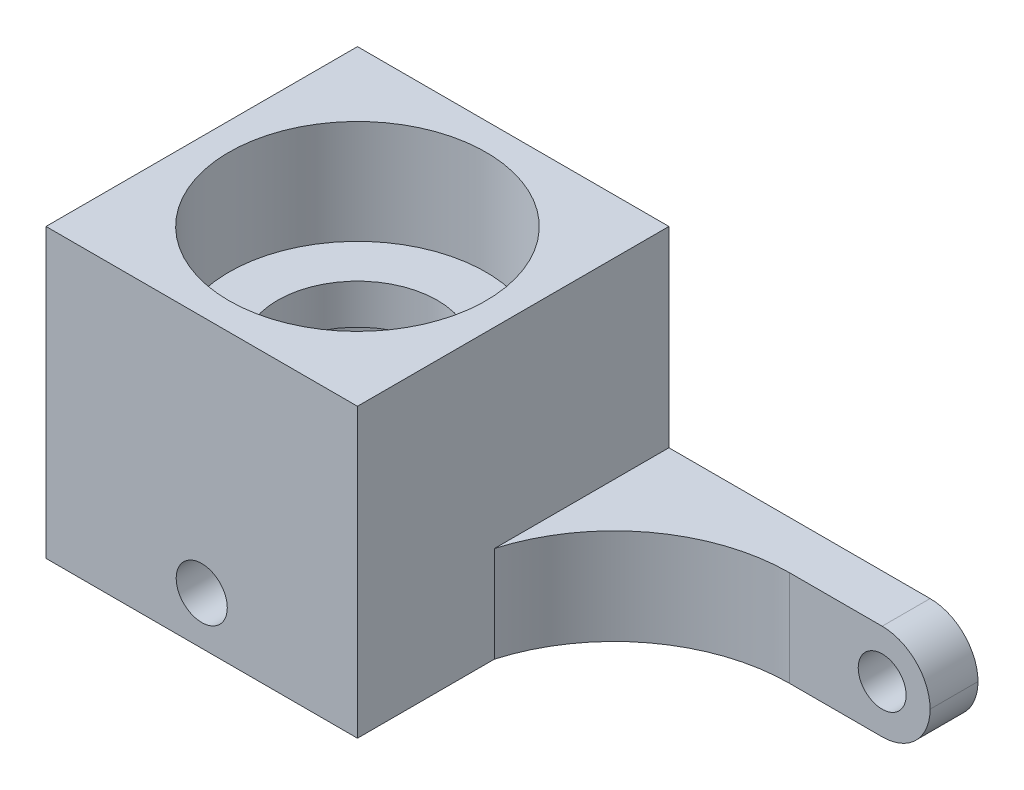
ISO-10303-21;
HEADER;
FILE_DESCRIPTION(('STEP AP214'),'2;1');
FILE_NAME('part.step','',(''),(''),'','','');
FILE_SCHEMA(('AUTOMOTIVE_DESIGN { 1 0 10303 214 1 1 1 1 }'));
ENDSEC;
DATA;
#1=APPLICATION_CONTEXT('core data for automotive mechanical design processes');
#2=APPLICATION_PROTOCOL_DEFINITION('international standard','automotive_design',2000,#1);
#3=PRODUCT_CONTEXT('',#1,'mechanical');
#4=PRODUCT('Part','Part','',(#3));
#5=PRODUCT_RELATED_PRODUCT_CATEGORY('part','',(#4));
#6=PRODUCT_DEFINITION_FORMATION('','',#4);
#7=PRODUCT_DEFINITION_CONTEXT('part definition',#1,'design');
#8=PRODUCT_DEFINITION('design','',#6,#7);
#9=PRODUCT_DEFINITION_SHAPE('','',#8);
#10=(LENGTH_UNIT() NAMED_UNIT(*) SI_UNIT(.MILLI.,.METRE.));
#11=(NAMED_UNIT(*) PLANE_ANGLE_UNIT() SI_UNIT($,.RADIAN.));
#12=(NAMED_UNIT(*) SI_UNIT($,.STERADIAN.) SOLID_ANGLE_UNIT());
#13=UNCERTAINTY_MEASURE_WITH_UNIT(LENGTH_MEASURE(1.E-05),#10,'distance_accuracy_value','');
#14=(GEOMETRIC_REPRESENTATION_CONTEXT(3) GLOBAL_UNCERTAINTY_ASSIGNED_CONTEXT((#13)) GLOBAL_UNIT_ASSIGNED_CONTEXT((#10,
#11,#12)) REPRESENTATION_CONTEXT('',''));
#15=CARTESIAN_POINT('',(0.,0.,0.));
#16=DIRECTION('',(0.,0.,1.));
#17=DIRECTION('',(1.,0.,0.));
#18=AXIS2_PLACEMENT_3D('',#15,#16,#17);
#19=CARTESIAN_POINT('',(0.,18.,0.));
#20=DIRECTION('',(0.,1.,0.));
#21=DIRECTION('',(0.,0.,1.));
#22=AXIS2_PLACEMENT_3D('',#19,#20,#21);
#23=PLANE('',#22);
#24=CARTESIAN_POINT('',(0.,18.,0.));
#25=DIRECTION('',(0.,1.,0.));
#26=DIRECTION('',(0.,0.,1.));
#27=AXIS2_PLACEMENT_3D('',#24,#25,#26);
#28=CIRCLE('',#27,8.05);
#29=CARTESIAN_POINT('',(0.,18.,8.05));
#30=VERTEX_POINT('',#29);
#31=EDGE_CURVE('E153',#30,#30,#28,.T.);
#32=ORIENTED_EDGE('',*,*,#31,.F.);
#33=EDGE_LOOP('',(#32));
#34=FACE_BOUND('',#33,.T.);
#35=DIRECTION('',(0.,0.,-1.));
#36=VECTOR('',#35,1.);
#37=CARTESIAN_POINT('',(-9.75,18.,-6.75));
#38=LINE('',#37,#36);
#39=CARTESIAN_POINT('',(-9.75,18.,9.75));
#40=VERTEX_POINT('',#39);
#41=CARTESIAN_POINT('',(-9.75,18.,-9.75));
#42=VERTEX_POINT('',#41);
#43=EDGE_CURVE('E170',#40,#42,#38,.T.);
#44=ORIENTED_EDGE('',*,*,#43,.F.);
#45=DIRECTION('',(-1.,0.,0.));
#46=VECTOR('',#45,1.);
#47=CARTESIAN_POINT('',(-9.75,18.,9.75));
#48=LINE('',#47,#46);
#49=CARTESIAN_POINT('',(9.75,18.,9.75));
#50=VERTEX_POINT('',#49);
#51=EDGE_CURVE('E137',#50,#40,#48,.T.);
#52=ORIENTED_EDGE('',*,*,#51,.F.);
#53=DIRECTION('',(0.,0.,-1.));
#54=VECTOR('',#53,1.);
#55=CARTESIAN_POINT('',(9.75,18.,-6.75));
#56=LINE('',#55,#54);
#57=CARTESIAN_POINT('',(9.75,18.,-9.75));
#58=VERTEX_POINT('',#57);
#59=EDGE_CURVE('E188',#50,#58,#56,.T.);
#60=ORIENTED_EDGE('',*,*,#59,.T.);
#61=DIRECTION('',(1.,0.,0.));
#62=VECTOR('',#61,1.);
#63=CARTESIAN_POINT('',(0.,18.,-9.75));
#64=LINE('',#63,#62);
#65=EDGE_CURVE('E172',#42,#58,#64,.T.);
#66=ORIENTED_EDGE('',*,*,#65,.F.);
#67=EDGE_LOOP('',(#44,#52,#60,#66));
#68=FACE_BOUND('',#67,.T.);
#69=ADVANCED_FACE('F39',(#34,#68),#23,.T.);
#70=CARTESIAN_POINT('',(0.,0.,0.));
#71=DIRECTION('',(0.,1.,0.));
#72=DIRECTION('',(0.,0.,1.));
#73=AXIS2_PLACEMENT_3D('',#70,#71,#72);
#74=PLANE('',#73);
#75=CARTESIAN_POINT('',(0.,0.,0.));
#76=DIRECTION('',(0.,1.,0.));
#77=DIRECTION('',(0.,0.,1.));
#78=AXIS2_PLACEMENT_3D('',#75,#76,#77);
#79=CIRCLE('',#78,7.5);
#80=CARTESIAN_POINT('',(0.,0.,7.5));
#81=VERTEX_POINT('',#80);
#82=EDGE_CURVE('E152',#81,#81,#79,.T.);
#83=ORIENTED_EDGE('',*,*,#82,.T.);
#84=EDGE_LOOP('',(#83));
#85=FACE_BOUND('',#84,.T.);
#86=CARTESIAN_POINT('',(20.3100960115899,0.,4.25));
#87=DIRECTION('',(0.,1.,0.));
#88=DIRECTION('',(0.,0.,1.));
#89=AXIS2_PLACEMENT_3D('',#86,#87,#88);
#90=CIRCLE('',#89,11.);
#91=CARTESIAN_POINT('',(20.3100960115899,0.,-6.75));
#92=VERTEX_POINT('',#91);
#93=CARTESIAN_POINT('',(9.75,0.,1.17032920168355));
#94=VERTEX_POINT('',#93);
#95=EDGE_CURVE('E275',#92,#94,#90,.T.);
#96=ORIENTED_EDGE('',*,*,#95,.T.);
#97=DIRECTION('',(0.,0.,1.));
#98=VECTOR('',#97,1.);
#99=CARTESIAN_POINT('',(9.75,0.,-9.751));
#100=LINE('',#99,#98);
#101=CARTESIAN_POINT('',(9.75,0.,9.75));
#102=VERTEX_POINT('',#101);
#103=EDGE_CURVE('E127',#94,#102,#100,.T.);
#104=ORIENTED_EDGE('',*,*,#103,.T.);
#105=DIRECTION('',(1.,0.,0.));
#106=VECTOR('',#105,1.);
#107=CARTESIAN_POINT('',(9.75,0.,9.75));
#108=LINE('',#107,#106);
#109=CARTESIAN_POINT('',(-9.75,0.,9.75));
#110=VERTEX_POINT('',#109);
#111=EDGE_CURVE('E124',#110,#102,#108,.T.);
#112=ORIENTED_EDGE('',*,*,#111,.F.);
#113=DIRECTION('',(0.,0.,-1.));
#114=VECTOR('',#113,1.);
#115=CARTESIAN_POINT('',(-9.75,0.,-6.75));
#116=LINE('',#115,#114);
#117=CARTESIAN_POINT('',(-9.75,0.,-9.75));
#118=VERTEX_POINT('',#117);
#119=EDGE_CURVE('E110',#110,#118,#116,.T.);
#120=ORIENTED_EDGE('',*,*,#119,.T.);
#121=DIRECTION('',(-1.,0.,0.));
#122=VECTOR('',#121,1.);
#123=CARTESIAN_POINT('',(0.,0.,-9.75));
#124=LINE('',#123,#122);
#125=CARTESIAN_POINT('',(26.1,0.,-9.75));
#126=VERTEX_POINT('',#125);
#127=EDGE_CURVE('E179',#126,#118,#124,.T.);
#128=ORIENTED_EDGE('',*,*,#127,.F.);
#129=DIRECTION('',(0.,0.,-1.));
#130=VECTOR('',#129,1.);
#131=CARTESIAN_POINT('',(26.1,0.,0.));
#132=LINE('',#131,#130);
#133=CARTESIAN_POINT('',(26.1,0.,-6.75));
#134=VERTEX_POINT('',#133);
#135=EDGE_CURVE('E265',#126,#134,#132,.F.);
#136=ORIENTED_EDGE('',*,*,#135,.T.);
#137=DIRECTION('',(-1.,0.,0.));
#138=VECTOR('',#137,1.);
#139=CARTESIAN_POINT('',(0.,0.,-6.75));
#140=LINE('',#139,#138);
#141=EDGE_CURVE('E164',#134,#92,#140,.T.);
#142=ORIENTED_EDGE('',*,*,#141,.T.);
#143=EDGE_LOOP('',(#96,#104,#112,#120,#128,#136,#142));
#144=FACE_BOUND('',#143,.T.);
#145=ADVANCED_FACE('F126',(#85,#144),#74,.F.);
#146=CARTESIAN_POINT('',(0.,3.,-6.75));
#147=DIRECTION('',(0.,0.,-1.));
#148=DIRECTION('',(-1.,0.,0.));
#149=AXIS2_PLACEMENT_3D('',#146,#147,#148);
#150=CYLINDRICAL_SURFACE('',#149,1.6);
#151=CARTESIAN_POINT('',(0.,3.,-9.75));
#152=DIRECTION('',(0.,0.,-1.));
#153=DIRECTION('',(-1.,0.,0.));
#154=AXIS2_PLACEMENT_3D('',#151,#152,#153);
#155=CIRCLE('',#154,1.6);
#156=CARTESIAN_POINT('',(-1.6,3.,-9.75));
#157=VERTEX_POINT('',#156);
#158=EDGE_CURVE('E181',#157,#157,#155,.T.);
#159=ORIENTED_EDGE('',*,*,#158,.T.);
#160=EDGE_LOOP('',(#159));
#161=FACE_BOUND('',#160,.T.);
#162=CARTESIAN_POINT('',(0.,4.6,-7.5));
#163=CARTESIAN_POINT('',(-0.0887944293338553,4.59999689419536,-7.4999983570598));
#164=CARTESIAN_POINT('',(-0.17762688970068,4.59258336552044,-7.49840703800838));
#165=CARTESIAN_POINT('',(-0.352772204992272,4.56315376142797,-7.49221258982039));
#166=CARTESIAN_POINT('',(-0.439083150622766,4.54112690542328,-7.48760723719598));
#167=CARTESIAN_POINT('',(-0.606628580180659,4.48318904804614,-7.47589793294748));
#168=CARTESIAN_POINT('',(-0.68786813944526,4.44729219487858,-7.46879652810656));
#169=CARTESIAN_POINT('',(-0.84316775772707,4.36267739239734,-7.45286320133509));
#170=CARTESIAN_POINT('',(-0.917228073407918,4.31395990166309,-7.4440313413038));
#171=CARTESIAN_POINT('',(-1.05720419368928,4.20429716953458,-7.42545480782523));
#172=CARTESIAN_POINT('',(-1.12299434543085,4.14319336689695,-7.41569927510424));
#173=CARTESIAN_POINT('',(-1.24347351522622,4.010833063914,-7.39645215099328));
#174=CARTESIAN_POINT('',(-1.29816158128342,3.9395756937978,-7.38696058229821));
#175=CARTESIAN_POINT('',(-1.39543277767187,3.78800940494011,-7.36920930951561));
#176=CARTESIAN_POINT('',(-1.43788322502763,3.70761355668354,-7.36096353805546));
#177=CARTESIAN_POINT('',(-1.50862340101052,3.54062468310146,-7.34679287525929));
#178=CARTESIAN_POINT('',(-1.53691473453874,3.45403236140341,-7.34086772090353));
#179=CARTESIAN_POINT('',(-1.5781204953587,3.27846838088968,-7.33211955105286));
#180=CARTESIAN_POINT('',(-1.59125680705956,3.18955107459205,-7.32925182047022));
#181=CARTESIAN_POINT('',(-1.60246934089929,3.01073195584931,-7.32680881403605));
#182=CARTESIAN_POINT('',(-1.60054732105774,2.92083025955284,-7.32723315384412));
#183=CARTESIAN_POINT('',(-1.58187655808685,2.74423604448313,-7.33128581769295));
#184=CARTESIAN_POINT('',(-1.56538455643806,2.6575149158877,-7.33485865843677));
#185=CARTESIAN_POINT('',(-1.51844828834832,2.48809934830167,-7.34471814062502));
#186=CARTESIAN_POINT('',(-1.48800327344862,2.4054051255831,-7.3510049276482));
#187=CARTESIAN_POINT('',(-1.41378668233802,2.24566362655982,-7.36563922179753));
#188=CARTESIAN_POINT('',(-1.36991548636567,2.16866409520861,-7.37400204199821));
#189=CARTESIAN_POINT('',(-1.2701619921725,2.02302428677124,-7.39183660364213));
#190=CARTESIAN_POINT('',(-1.21427813244001,1.95438509825491,-7.40130848917848));
#191=CARTESIAN_POINT('',(-1.09072196751541,1.82593524608154,-7.4205326849195));
#192=CARTESIAN_POINT('',(-1.02283110172082,1.76633488213618,-7.43028675890513));
#193=CARTESIAN_POINT('',(-0.8779087587018,1.65933258631255,-7.44879883076769));
#194=CARTESIAN_POINT('',(-0.800877131200495,1.61193085502408,-7.45755681226393));
#195=CARTESIAN_POINT('',(-0.63961008182726,1.53062332499257,-7.4731161994162));
#196=CARTESIAN_POINT('',(-0.555360898326546,1.49674403771802,-7.47991375438739));
#197=CARTESIAN_POINT('',(-0.382188547319411,1.44368065879573,-7.49075760800742));
#198=CARTESIAN_POINT('',(-0.293266027489784,1.42449453653412,-7.49480428682212));
#199=CARTESIAN_POINT('',(-0.115076046551736,1.40166556981615,-7.49963667143352));
#200=CARTESIAN_POINT('',(-0.0258469966592095,1.39773530031402,-7.50048267119555));
#201=CARTESIAN_POINT('',(0.151992686528,1.40475203121251,-7.49898689492793));
#202=CARTESIAN_POINT('',(0.240603359252846,1.41569807416565,-7.49664532405204));
#203=CARTESIAN_POINT('',(0.413746062380252,1.45191822521633,-7.48907546339841));
#204=CARTESIAN_POINT('',(0.4983108633353,1.47704254852517,-7.48387736587364));
#205=CARTESIAN_POINT('',(0.662026395792983,1.54074058388017,-7.47117587533623));
#206=CARTESIAN_POINT('',(0.741176681186477,1.5793154025379,-7.46367229265062));
#207=CARTESIAN_POINT('',(0.893011950773003,1.66942507461825,-7.44704294085318));
#208=CARTESIAN_POINT('',(0.96559365973848,1.72113002651483,-7.43789638159133));
#209=CARTESIAN_POINT('',(1.10115356003048,1.83580715603025,-7.41903990869546));
#210=CARTESIAN_POINT('',(1.16413056725132,1.89878072081181,-7.40932992580373));
#211=CARTESIAN_POINT('',(1.27982177561402,2.0355234396277,-7.39023419815026));
#212=CARTESIAN_POINT('',(1.33233743532724,2.10946199340809,-7.38085708289827));
#213=CARTESIAN_POINT('',(1.42420609305472,2.26527871151166,-7.36368318738415));
#214=CARTESIAN_POINT('',(1.46355965021716,2.34715653837054,-7.35588633999514));
#215=CARTESIAN_POINT('',(1.52772807228231,2.5160945750566,-7.3428278116798));
#216=CARTESIAN_POINT('',(1.55262307368944,2.60312321577051,-7.33755218632522));
#217=CARTESIAN_POINT('',(1.58740514879097,2.78025472587967,-7.33010689029808));
#218=CARTESIAN_POINT('',(1.59729448874882,2.87035712895102,-7.32793675061545));
#219=CARTESIAN_POINT('',(1.60169174862619,3.04907925727694,-7.32697666157729));
#220=CARTESIAN_POINT('',(1.59651412882043,3.13769102055621,-7.32811760571581));
#221=CARTESIAN_POINT('',(1.57162478005708,3.31274860255213,-7.33349539816059));
#222=CARTESIAN_POINT('',(1.55191320540031,3.39919444425337,-7.33773221359929));
#223=CARTESIAN_POINT('',(1.49866402761734,3.5672312446234,-7.34879149338567));
#224=CARTESIAN_POINT('',(1.46517005919756,3.64883660353434,-7.35560579203591));
#225=CARTESIAN_POINT('',(1.38534516691845,3.80531708369126,-7.37105584436333));
#226=CARTESIAN_POINT('',(1.33901298148491,3.8801915425531,-7.37969177702726));
#227=CARTESIAN_POINT('',(1.23377464987916,4.02263967744949,-7.39801997202294));
#228=CARTESIAN_POINT('',(1.17464349733652,4.09004494825338,-7.40772937703983));
#229=CARTESIAN_POINT('',(1.0459443480745,4.21407953214308,-7.42699305436863));
#230=CARTESIAN_POINT('',(0.976373947694452,4.27070635663728,-7.43654729038956));
#231=CARTESIAN_POINT('',(0.827748193968449,4.37223603945681,-7.4545622712928));
#232=CARTESIAN_POINT('',(0.748587403501142,4.41698730989109,-7.46300824065792));
#233=CARTESIAN_POINT('',(0.583706040029165,4.49247899855657,-7.47770774713458));
#234=CARTESIAN_POINT('',(0.497991165498192,4.52323142992907,-7.48396316300769));
#235=CARTESIAN_POINT('',(0.343464763103909,4.56422976291382,-7.49243099511991));
#236=CARTESIAN_POINT('',(0.275502835649662,4.57761851465133,-7.4952520823403));
#237=CARTESIAN_POINT('',(0.138368271279889,4.5955046639985,-7.49903718747764));
#238=CARTESIAN_POINT('',(0.0691956833185953,4.60000242029006,-7.5000012803097));
#239=CARTESIAN_POINT('',(0.,4.6,-7.5));
#240=B_SPLINE_CURVE_WITH_KNOTS('',3,(#162,#163,#164,#165,#166,#167,#168,#169,#170,#171,#172,
#173,#174,#175,#176,#177,#178,#179,#180,#181,#182,#183,#184,#185,#186,#187,#188,#189,#190,#191,
#192,#193,#194,#195,#196,#197,#198,#199,#200,#201,#202,#203,#204,#205,#206,#207,#208,#209,#210,
#211,#212,#213,#214,#215,#216,#217,#218,#219,#220,#221,#222,#223,#224,#225,#226,#227,#228,#229,
#230,#231,#232,#233,#234,#235,#236,#237,#238,#239),.UNSPECIFIED.,.T.,.F.,(4,2,2,2,2,2,2,2,2,2,2,
2,2,2,2,2,2,2,2,2,2,2,2,2,2,2,2,2,2,2,2,2,2,2,2,2,2,2,4),(0.,0.266130047854763,
0.532456644597192,0.798512286868044,1.0645584139285,1.33425388789939,1.60397247832158,
1.87651399120586,2.14902460517277,2.41749263134366,2.68592931506411,2.94972810159234,
3.21354104030559,3.47936093436642,3.74521540295247,4.01653060252532,4.28785026321978,
4.55969927797481,4.83151071607125,5.09817555204361,5.36482322613614,5.62870529395038,
5.89260907723842,6.16012360036748,6.4276710771331,6.69989324302712,6.97210384299802,
7.24279095265698,7.51343717712193,7.77847555890144,8.04351112692154,8.30771397733334,
8.57194279940302,8.84126112654218,9.11064156026669,9.38331104903344,9.655746102577,
9.86314417471902,10.0705338798061),.UNSPECIFIED.);
#241=CARTESIAN_POINT('',(0.,4.6,-7.5));
#242=VERTEX_POINT('',#241);
#243=EDGE_CURVE('E156',#242,#242,#240,.T.);
#244=ORIENTED_EDGE('',*,*,#243,.T.);
#245=EDGE_LOOP('',(#244));
#246=FACE_BOUND('',#245,.T.);
#247=ADVANCED_FACE('F242',(#161,#246),#150,.F.);
#248=CARTESIAN_POINT('',(0.,0.,-6.75));
#249=DIRECTION('',(0.,0.,-1.));
#250=DIRECTION('',(-1.,0.,0.));
#251=AXIS2_PLACEMENT_3D('',#248,#249,#250);
#252=PLANE('',#251);
#253=CARTESIAN_POINT('',(26.1,3.,-6.75));
#254=DIRECTION('',(0.,0.,-1.));
#255=DIRECTION('',(-1.,0.,0.));
#256=AXIS2_PLACEMENT_3D('',#253,#254,#255);
#257=CIRCLE('',#256,1.5);
#258=CARTESIAN_POINT('',(24.6,3.,-6.75));
#259=VERTEX_POINT('',#258);
#260=EDGE_CURVE('E167',#259,#259,#257,.T.);
#261=ORIENTED_EDGE('',*,*,#260,.T.);
#262=EDGE_LOOP('',(#261));
#263=FACE_BOUND('',#262,.T.);
#264=ORIENTED_EDGE('',*,*,#141,.F.);
#265=CARTESIAN_POINT('',(26.1,3.,-6.75));
#266=DIRECTION('',(0.,0.,-1.));
#267=DIRECTION('',(-1.,0.,0.));
#268=AXIS2_PLACEMENT_3D('',#265,#266,#267);
#269=CIRCLE('',#268,3.);
#270=CARTESIAN_POINT('',(29.1,3.,-6.75));
#271=VERTEX_POINT('',#270);
#272=EDGE_CURVE('E54',#134,#271,#269,.F.);
#273=ORIENTED_EDGE('',*,*,#272,.T.);
#274=CARTESIAN_POINT('',(26.1,3.,-6.75));
#275=DIRECTION('',(0.,0.,-1.));
#276=DIRECTION('',(-1.,0.,0.));
#277=AXIS2_PLACEMENT_3D('',#274,#275,#276);
#278=CIRCLE('',#277,3.);
#279=CARTESIAN_POINT('',(26.1,6.,-6.75));
#280=VERTEX_POINT('',#279);
#281=EDGE_CURVE('E58',#271,#280,#278,.F.);
#282=ORIENTED_EDGE('',*,*,#281,.T.);
#283=DIRECTION('',(-1.,0.,0.));
#284=VECTOR('',#283,1.);
#285=CARTESIAN_POINT('',(0.,6.,-6.75));
#286=LINE('',#285,#284);
#287=CARTESIAN_POINT('',(20.3100960115899,6.,-6.75));
#288=VERTEX_POINT('',#287);
#289=EDGE_CURVE('E162',#280,#288,#286,.T.);
#290=ORIENTED_EDGE('',*,*,#289,.T.);
#291=DIRECTION('',(0.,1.,0.));
#292=VECTOR('',#291,1.);
#293=CARTESIAN_POINT('',(20.3100960115899,0.,-6.75));
#294=LINE('',#293,#292);
#295=EDGE_CURVE('E120',#288,#92,#294,.F.);
#296=ORIENTED_EDGE('',*,*,#295,.T.);
#297=EDGE_LOOP('',(#264,#273,#282,#290,#296));
#298=FACE_BOUND('',#297,.T.);
#299=ADVANCED_FACE('F272',(#263,#298),#252,.F.);
#300=CARTESIAN_POINT('',(0.,0.,-9.75));
#301=DIRECTION('',(0.,0.,-1.));
#302=DIRECTION('',(-1.,0.,0.));
#303=AXIS2_PLACEMENT_3D('',#300,#301,#302);
#304=PLANE('',#303);
#305=CARTESIAN_POINT('',(26.1,3.,-9.75));
#306=DIRECTION('',(0.,0.,-1.));
#307=DIRECTION('',(-1.,0.,0.));
#308=AXIS2_PLACEMENT_3D('',#305,#306,#307);
#309=CIRCLE('',#308,3.);
#310=CARTESIAN_POINT('',(26.1,6.,-9.75));
#311=VERTEX_POINT('',#310);
#312=CARTESIAN_POINT('',(29.1,3.,-9.75));
#313=VERTEX_POINT('',#312);
#314=EDGE_CURVE('E280',#311,#313,#309,.T.);
#315=ORIENTED_EDGE('',*,*,#314,.T.);
#316=CARTESIAN_POINT('',(26.1,3.,-9.75));
#317=DIRECTION('',(0.,0.,-1.));
#318=DIRECTION('',(-1.,0.,0.));
#319=AXIS2_PLACEMENT_3D('',#316,#317,#318);
#320=CIRCLE('',#319,3.);
#321=EDGE_CURVE('E269',#313,#126,#320,.T.);
#322=ORIENTED_EDGE('',*,*,#321,.T.);
#323=ORIENTED_EDGE('',*,*,#127,.T.);
#324=DIRECTION('',(0.,-1.,0.));
#325=VECTOR('',#324,1.);
#326=CARTESIAN_POINT('',(-9.75,0.,-9.75));
#327=LINE('',#326,#325);
#328=EDGE_CURVE('E117',#42,#118,#327,.T.);
#329=ORIENTED_EDGE('',*,*,#328,.F.);
#330=ORIENTED_EDGE('',*,*,#65,.T.);
#331=DIRECTION('',(0.,-1.,0.));
#332=VECTOR('',#331,1.);
#333=CARTESIAN_POINT('',(9.75,0.,-9.75));
#334=LINE('',#333,#332);
#335=CARTESIAN_POINT('',(9.75,6.,-9.75));
#336=VERTEX_POINT('',#335);
#337=EDGE_CURVE('E174',#58,#336,#334,.T.);
#338=ORIENTED_EDGE('',*,*,#337,.T.);
#339=DIRECTION('',(-1.,0.,0.));
#340=VECTOR('',#339,1.);
#341=CARTESIAN_POINT('',(0.,6.,-9.75));
#342=LINE('',#341,#340);
#343=EDGE_CURVE('E177',#311,#336,#342,.T.);
#344=ORIENTED_EDGE('',*,*,#343,.F.);
#345=EDGE_LOOP('',(#315,#322,#323,#329,#330,#338,#344));
#346=FACE_BOUND('',#345,.T.);
#347=CARTESIAN_POINT('',(26.1,3.,-9.75));
#348=DIRECTION('',(0.,0.,-1.));
#349=DIRECTION('',(-1.,0.,0.));
#350=AXIS2_PLACEMENT_3D('',#347,#348,#349);
#351=CIRCLE('',#350,1.5);
#352=CARTESIAN_POINT('',(24.6,3.,-9.75));
#353=VERTEX_POINT('',#352);
#354=EDGE_CURVE('E165',#353,#353,#351,.T.);
#355=ORIENTED_EDGE('',*,*,#354,.F.);
#356=EDGE_LOOP('',(#355));
#357=FACE_BOUND('',#356,.T.);
#358=ORIENTED_EDGE('',*,*,#158,.F.);
#359=EDGE_LOOP('',(#358));
#360=FACE_BOUND('',#359,.T.);
#361=ADVANCED_FACE('F293',(#346,#357,#360),#304,.T.);
#362=CARTESIAN_POINT('',(-9.75,0.,-6.75));
#363=DIRECTION('',(1.,0.,0.));
#364=DIRECTION('',(0.,0.,-1.));
#365=AXIS2_PLACEMENT_3D('',#362,#363,#364);
#366=PLANE('',#365);
#367=ORIENTED_EDGE('',*,*,#328,.T.);
#368=ORIENTED_EDGE('',*,*,#119,.F.);
#369=DIRECTION('',(0.,-1.,0.));
#370=VECTOR('',#369,1.);
#371=CARTESIAN_POINT('',(-9.75,18.,9.75));
#372=LINE('',#371,#370);
#373=EDGE_CURVE('E115',#40,#110,#372,.T.);
#374=ORIENTED_EDGE('',*,*,#373,.F.);
#375=ORIENTED_EDGE('',*,*,#43,.T.);
#376=EDGE_LOOP('',(#367,#368,#374,#375));
#377=FACE_BOUND('',#376,.T.);
#378=ADVANCED_FACE('F112',(#377),#366,.F.);
#379=CARTESIAN_POINT('',(0.,6.,-6.75));
#380=DIRECTION('',(0.,-1.,0.));
#381=DIRECTION('',(0.,0.,-1.));
#382=AXIS2_PLACEMENT_3D('',#379,#380,#381);
#383=PLANE('',#382);
#384=DIRECTION('',(0.,0.,-1.));
#385=VECTOR('',#384,1.);
#386=CARTESIAN_POINT('',(9.75,6.,-6.75));
#387=LINE('',#386,#385);
#388=CARTESIAN_POINT('',(9.75,6.,1.17032920168355));
#389=VERTEX_POINT('',#388);
#390=EDGE_CURVE('E121',#389,#336,#387,.T.);
#391=ORIENTED_EDGE('',*,*,#390,.F.);
#392=CARTESIAN_POINT('',(20.3100960115899,6.,4.25));
#393=DIRECTION('',(0.,-1.,0.));
#394=DIRECTION('',(0.,0.,-1.));
#395=AXIS2_PLACEMENT_3D('',#392,#393,#394);
#396=CIRCLE('',#395,11.);
#397=EDGE_CURVE('E276',#389,#288,#396,.T.);
#398=ORIENTED_EDGE('',*,*,#397,.T.);
#399=ORIENTED_EDGE('',*,*,#289,.F.);
#400=DIRECTION('',(0.,0.,-1.));
#401=VECTOR('',#400,1.);
#402=CARTESIAN_POINT('',(26.1,6.,-6.75));
#403=LINE('',#402,#401);
#404=EDGE_CURVE('E47',#280,#311,#403,.T.);
#405=ORIENTED_EDGE('',*,*,#404,.T.);
#406=ORIENTED_EDGE('',*,*,#343,.T.);
#407=EDGE_LOOP('',(#391,#398,#399,#405,#406));
#408=FACE_BOUND('',#407,.T.);
#409=ADVANCED_FACE('F290',(#408),#383,.F.);
#410=CARTESIAN_POINT('',(9.75,0.,-6.75));
#411=DIRECTION('',(1.,0.,0.));
#412=DIRECTION('',(0.,0.,-1.));
#413=AXIS2_PLACEMENT_3D('',#410,#411,#412);
#414=PLANE('',#413);
#415=ORIENTED_EDGE('',*,*,#59,.F.);
#416=DIRECTION('',(0.,1.,0.));
#417=VECTOR('',#416,1.);
#418=CARTESIAN_POINT('',(9.75,18.,9.75));
#419=LINE('',#418,#417);
#420=EDGE_CURVE('E131',#102,#50,#419,.T.);
#421=ORIENTED_EDGE('',*,*,#420,.F.);
#422=ORIENTED_EDGE('',*,*,#103,.F.);
#423=DIRECTION('',(0.,-1.,0.));
#424=VECTOR('',#423,1.);
#425=CARTESIAN_POINT('',(9.75,18.,1.17032920168355));
#426=LINE('',#425,#424);
#427=EDGE_CURVE('E11',#389,#94,#426,.T.);
#428=ORIENTED_EDGE('',*,*,#427,.F.);
#429=ORIENTED_EDGE('',*,*,#390,.T.);
#430=ORIENTED_EDGE('',*,*,#337,.F.);
#431=EDGE_LOOP('',(#415,#421,#422,#428,#429,#430));
#432=FACE_BOUND('',#431,.T.);
#433=ADVANCED_FACE('F297',(#432),#414,.T.);
#434=CARTESIAN_POINT('',(26.1,3.,-6.75));
#435=DIRECTION('',(0.,0.,-1.));
#436=DIRECTION('',(-1.,0.,0.));
#437=AXIS2_PLACEMENT_3D('',#434,#435,#436);
#438=CYLINDRICAL_SURFACE('',#437,1.5);
#439=ORIENTED_EDGE('',*,*,#260,.F.);
#440=EDGE_LOOP('',(#439));
#441=FACE_BOUND('',#440,.T.);
#442=ORIENTED_EDGE('',*,*,#354,.T.);
#443=EDGE_LOOP('',(#442));
#444=FACE_BOUND('',#443,.T.);
#445=ADVANCED_FACE('F232',(#441,#444),#438,.F.);
#446=CARTESIAN_POINT('',(0.,9.,0.));
#447=DIRECTION('',(0.,-1.,0.));
#448=DIRECTION('',(0.,0.,-1.));
#449=AXIS2_PLACEMENT_3D('',#446,#447,#448);
#450=CYLINDRICAL_SURFACE('',#449,7.5);
#451=ORIENTED_EDGE('',*,*,#243,.F.);
#452=EDGE_LOOP('',(#451));
#453=FACE_BOUND('',#452,.T.);
#454=CARTESIAN_POINT('',(-1.6,3.,7.32734604068895));
#455=CARTESIAN_POINT('',(-1.59999687521768,3.0887685100711,7.3273478320489));
#456=CARTESIAN_POINT('',(-1.59258752711157,3.1775750992943,7.32897670533243));
#457=CARTESIAN_POINT('',(-1.56317603196586,3.35266670741716,7.33530494590012));
#458=CARTESIAN_POINT('',(-1.54116300148996,3.43894979556067,7.3400066031465));
#459=CARTESIAN_POINT('',(-1.48326555897741,3.6064362066757,7.35192423987447));
#460=CARTESIAN_POINT('',(-1.44739594342864,3.68764484120461,7.3591375365424));
#461=CARTESIAN_POINT('',(-1.36284536038589,3.84289225870409,7.37526247893005));
#462=CARTESIAN_POINT('',(-1.31416478963062,3.91693126361169,7.38417407205336));
#463=CARTESIAN_POINT('',(-1.20454002688148,4.05692983916243,7.40285153964238));
#464=CARTESIAN_POINT('',(-1.14342897607145,4.12275737738522,7.4126278874916));
#465=CARTESIAN_POINT('',(-1.01103827358584,4.24330916231062,7.43184148234544));
#466=CARTESIAN_POINT('',(-0.939757855827597,4.29803257175975,7.44127870373573));
#467=CARTESIAN_POINT('',(-0.788169783859914,4.39534204711686,7.45886446546389));
#468=CARTESIAN_POINT('',(-0.707779159305538,4.4378015699902,7.46699920907061));
#469=CARTESIAN_POINT('',(-0.540801563567201,4.50855994533145,7.48094533800134));
#470=CARTESIAN_POINT('',(-0.454215254422201,4.53686030819922,7.48675697112518));
#471=CARTESIAN_POINT('',(-0.278676257286042,4.57808300960865,7.4953280596337));
#472=CARTESIAN_POINT('',(-0.189778209864772,4.59122866317342,7.49813179441585));
#473=CARTESIAN_POINT('',(-0.0109972872482629,4.60246656338555,7.5005244520832));
#474=CARTESIAN_POINT('',(0.0788854794810493,4.6005604516498,7.50011372555284));
#475=CARTESIAN_POINT('',(0.255546402374116,4.58191615631798,7.49615771852237));
#476=CARTESIAN_POINT('',(0.342351262803163,4.56541862972292,7.49266329963279));
#477=CARTESIAN_POINT('',(0.511931382190347,4.51844277484243,7.48299031427627));
#478=CARTESIAN_POINT('',(0.594706464721115,4.4879638350457,7.47681163040705));
#479=CARTESIAN_POINT('',(0.75455088288095,4.41367449572029,7.46238195623953));
#480=CARTESIAN_POINT('',(0.831576062489073,4.36977196910885,7.45411671633686));
#481=CARTESIAN_POINT('',(0.977254151163989,4.2699502243687,7.43642166419509));
#482=CARTESIAN_POINT('',(1.04590596996944,4.21402944400459,7.42699170062309));
#483=CARTESIAN_POINT('',(1.17431898714989,4.09044536673716,7.40778511114788));
#484=CARTESIAN_POINT('',(1.23387717194844,4.02257143781813,7.39800531840364));
#485=CARTESIAN_POINT('',(1.34080220178097,3.87769857523078,7.37937693038443));
#486=CARTESIAN_POINT('',(1.38816874804634,3.8006994180069,7.37052835793311));
#487=CARTESIAN_POINT('',(1.46945010087399,3.63944452104654,7.35475651444397));
#488=CARTESIAN_POINT('',(1.50332818047938,3.55516971894304,7.34783851514439));
#489=CARTESIAN_POINT('',(1.55638146230778,3.38194121509158,7.33678531116542));
#490=CARTESIAN_POINT('',(1.57555887179257,3.29298821790476,7.33264968873186));
#491=CARTESIAN_POINT('',(1.59835496135294,3.11477894000118,7.32771425542105));
#492=CARTESIAN_POINT('',(1.60226852153074,3.02556208684323,7.32685123090565));
#493=CARTESIAN_POINT('',(1.59522273599979,2.84775066778691,7.32838843572104));
#494=CARTESIAN_POINT('',(1.58426435850705,2.75915606175548,7.33078845261626));
#495=CARTESIAN_POINT('',(1.54804113817798,2.58612016761893,7.33852177157955));
#496=CARTESIAN_POINT('',(1.52293726454489,2.50164357089464,7.34382205072082));
#497=CARTESIAN_POINT('',(1.45930930111439,2.338095500714,7.35672914405465));
#498=CARTESIAN_POINT('',(1.42078397878081,2.25902452447175,7.36433617007512));
#499=CARTESIAN_POINT('',(1.3307517679701,2.10725190691673,7.38113944964658));
#500=CARTESIAN_POINT('',(1.27906237846836,2.03466097902885,7.39035742068727));
#501=CARTESIAN_POINT('',(1.16440942349652,1.89907535110419,7.40928600589101));
#502=CARTESIAN_POINT('',(1.10144452944021,1.83608178353945,7.41899667801202));
#503=CARTESIAN_POINT('',(0.964696649513286,1.72034234685536,7.43802394390858));
#504=CARTESIAN_POINT('',(0.890742299881096,1.66779703072942,7.44733055372857));
#505=CARTESIAN_POINT('',(0.734884872162139,1.57587637439103,7.46432047157701));
#506=CARTESIAN_POINT('',(0.652982155389737,1.53650043589063,7.47200385334324));
#507=CARTESIAN_POINT('',(0.484049906499256,1.47231945842675,7.48483934479639));
#508=CARTESIAN_POINT('',(0.397055665841014,1.44742477608376,7.49000699441327));
#509=CARTESIAN_POINT('',(0.219997709997884,1.41263173205883,7.49729580275604));
#510=CARTESIAN_POINT('',(0.1299344199227,1.40273130201046,7.49941738166686));
#511=CARTESIAN_POINT('',(-0.0487977681305976,1.39829699175499,7.50036328067436));
#512=CARTESIAN_POINT('',(-0.137459015607028,1.40346307298599,7.49925198227476));
#513=CARTESIAN_POINT('',(-0.312618673313176,1.42834658015262,7.49399416638132));
#514=CARTESIAN_POINT('',(-0.399117118774428,1.44806376889428,7.48984769836304));
#515=CARTESIAN_POINT('',(-0.567277052878256,1.50134901504738,7.47898934152454));
#516=CARTESIAN_POINT('',(-0.648951936497361,1.53487643213246,7.47228498421878));
#517=CARTESIAN_POINT('',(-0.805557846294829,1.61479002736397,7.4570285062036));
#518=CARTESIAN_POINT('',(-0.880488251937903,1.66117738710899,7.44847621571812));
#519=CARTESIAN_POINT('',(-1.02294779578885,1.76648248217597,7.43026476347602));
#520=CARTESIAN_POINT('',(-1.09031795731115,1.82561231982064,7.42058833247677));
#521=CARTESIAN_POINT('',(-1.21428232218523,1.95429363888894,7.40131497163695));
#522=CARTESIAN_POINT('',(-1.27087393971624,2.02384761397618,7.39171806140062));
#523=CARTESIAN_POINT('',(-1.37235806742356,2.17245456146852,7.37355623892386));
#524=CARTESIAN_POINT('',(-1.41709443670195,2.25161602988676,7.36500582897484));
#525=CARTESIAN_POINT('',(-1.49255808840325,2.41649726202728,7.3500858193436));
#526=CARTESIAN_POINT('',(-1.5232974824127,2.50221128052181,7.34371433542935));
#527=CARTESIAN_POINT('',(-1.56426527791603,2.6567046315602,7.33507966715627));
#528=CARTESIAN_POINT('',(-1.57764062026348,2.724632477038,7.3321984207885));
#529=CARTESIAN_POINT('',(-1.59550900254637,2.86169921223266,7.32833095153541));
#530=CARTESIAN_POINT('',(-1.60000243460258,2.93083804835046,7.32734464499187));
#531=CARTESIAN_POINT('',(-1.6,3.,7.32734604068895));
#532=B_SPLINE_CURVE_WITH_KNOTS('',3,(#454,#455,#456,#457,#458,#459,#460,#461,#462,#463,#464,
#465,#466,#467,#468,#469,#470,#471,#472,#473,#474,#475,#476,#477,#478,#479,#480,#481,#482,#483,
#484,#485,#486,#487,#488,#489,#490,#491,#492,#493,#494,#495,#496,#497,#498,#499,#500,#501,#502,
#503,#504,#505,#506,#507,#508,#509,#510,#511,#512,#513,#514,#515,#516,#517,#518,#519,#520,#521,
#522,#523,#524,#525,#526,#527,#528,#529,#530,#531),.UNSPECIFIED.,.T.,.F.,(4,2,2,2,2,2,2,2,2,2,2,
2,2,2,2,2,2,2,2,2,2,2,2,2,2,2,2,2,2,2,2,2,2,2,2,2,2,2,4),(0.,0.266052129745754,
0.532302758678047,0.798269859408134,1.0642287244504,1.33402614177927,1.60384389433342,
1.87635365044247,2.14883433092115,2.41724632343608,2.68562904207088,2.94966617354387,
3.21371485442776,3.47961802162732,3.74555577412268,4.01676058380498,4.28797203900695,
4.5599169909862,4.83182110323961,5.09844553370914,5.36505260681318,5.62868536677037,
5.89234234338365,6.15987500944546,6.42743921949374,6.69972716505266,6.97200273882468,
7.24257439749417,7.51310872903872,7.77829258282249,8.04347211400598,8.30787679551558,
8.57230577914046,8.84153310165342,9.11082493186947,9.38350466142432,9.65594799064848,
9.86324556645521,10.0705339902329),.UNSPECIFIED.);
#533=CARTESIAN_POINT('',(-1.6,3.,7.32734604068895));
#534=VERTEX_POINT('',#533);
#535=EDGE_CURVE('E192',#534,#534,#532,.T.);
#536=ORIENTED_EDGE('',*,*,#535,.F.);
#537=EDGE_LOOP('',(#536));
#538=FACE_BOUND('',#537,.T.);
#539=CARTESIAN_POINT('',(0.,9.,0.));
#540=DIRECTION('',(0.,1.,0.));
#541=DIRECTION('',(0.,0.,1.));
#542=AXIS2_PLACEMENT_3D('',#539,#540,#541);
#543=CIRCLE('',#542,7.5);
#544=CARTESIAN_POINT('',(0.,9.,7.5));
#545=VERTEX_POINT('',#544);
#546=EDGE_CURVE('E157',#545,#545,#543,.T.);
#547=ORIENTED_EDGE('',*,*,#546,.T.);
#548=EDGE_LOOP('',(#547));
#549=FACE_BOUND('',#548,.T.);
#550=ORIENTED_EDGE('',*,*,#82,.F.);
#551=EDGE_LOOP('',(#550));
#552=FACE_BOUND('',#551,.T.);
#553=ADVANCED_FACE('F205',(#453,#538,#549,#552),#450,.F.);
#554=CARTESIAN_POINT('',(0.,9.,0.));
#555=DIRECTION('',(0.,1.,0.));
#556=DIRECTION('',(0.,0.,1.));
#557=AXIS2_PLACEMENT_3D('',#554,#555,#556);
#558=PLANE('',#557);
#559=CARTESIAN_POINT('',(0.,9.,0.));
#560=DIRECTION('',(0.,1.,0.));
#561=DIRECTION('',(0.,0.,1.));
#562=AXIS2_PLACEMENT_3D('',#559,#560,#561);
#563=CIRCLE('',#562,5.);
#564=CARTESIAN_POINT('',(0.,9.,5.));
#565=VERTEX_POINT('',#564);
#566=EDGE_CURVE('E148',#565,#565,#563,.T.);
#567=ORIENTED_EDGE('',*,*,#566,.T.);
#568=EDGE_LOOP('',(#567));
#569=FACE_BOUND('',#568,.T.);
#570=ORIENTED_EDGE('',*,*,#546,.F.);
#571=EDGE_LOOP('',(#570));
#572=FACE_BOUND('',#571,.T.);
#573=ADVANCED_FACE('F225',(#569,#572),#558,.F.);
#574=CARTESIAN_POINT('',(0.,11.5,0.));
#575=DIRECTION('',(0.,1.,0.));
#576=DIRECTION('',(0.,0.,1.));
#577=AXIS2_PLACEMENT_3D('',#574,#575,#576);
#578=CYLINDRICAL_SURFACE('',#577,8.05);
#579=CARTESIAN_POINT('',(0.,11.5,0.));
#580=DIRECTION('',(0.,1.,0.));
#581=DIRECTION('',(0.,0.,1.));
#582=AXIS2_PLACEMENT_3D('',#579,#580,#581);
#583=CIRCLE('',#582,8.05);
#584=CARTESIAN_POINT('',(0.,11.5,8.05));
#585=VERTEX_POINT('',#584);
#586=EDGE_CURVE('E149',#585,#585,#583,.T.);
#587=CARTESIAN_POINT('',(0.,11.5,8.05));
#588=CARTESIAN_POINT('',(0.,11.5677083333333,8.05));
#589=CARTESIAN_POINT('',(0.,11.6354166666667,8.05));
#590=CARTESIAN_POINT('',(0.,11.7708333333333,8.05));
#591=CARTESIAN_POINT('',(0.,11.8385416666667,8.05));
#592=CARTESIAN_POINT('',(0.,11.9739583333333,8.05));
#593=CARTESIAN_POINT('',(0.,12.0416666666667,8.05));
#594=CARTESIAN_POINT('',(0.,12.1770833333333,8.05));
#595=CARTESIAN_POINT('',(0.,12.2447916666667,8.05));
#596=CARTESIAN_POINT('',(0.,12.3802083333333,8.05));
#597=CARTESIAN_POINT('',(0.,12.4479166666667,8.05));
#598=CARTESIAN_POINT('',(0.,12.5833333333333,8.05));
#599=CARTESIAN_POINT('',(0.,12.6510416666667,8.05));
#600=CARTESIAN_POINT('',(0.,12.7864583333333,8.05));
#601=CARTESIAN_POINT('',(0.,12.8541666666667,8.05));
#602=CARTESIAN_POINT('',(0.,12.9895833333333,8.05));
#603=CARTESIAN_POINT('',(0.,13.0572916666667,8.05));
#604=CARTESIAN_POINT('',(0.,13.1927083333333,8.05));
#605=CARTESIAN_POINT('',(0.,13.2604166666667,8.05));
#606=CARTESIAN_POINT('',(0.,13.3958333333333,8.05));
#607=CARTESIAN_POINT('',(0.,13.4635416666667,8.05));
#608=CARTESIAN_POINT('',(0.,13.5989583333333,8.05));
#609=CARTESIAN_POINT('',(0.,13.6666666666667,8.05));
#610=CARTESIAN_POINT('',(0.,13.8020833333333,8.05));
#611=CARTESIAN_POINT('',(0.,13.8697916666667,8.05));
#612=CARTESIAN_POINT('',(0.,14.0052083333333,8.05));
#613=CARTESIAN_POINT('',(0.,14.0729166666667,8.05));
#614=CARTESIAN_POINT('',(0.,14.2083333333333,8.05));
#615=CARTESIAN_POINT('',(0.,14.2760416666667,8.05));
#616=CARTESIAN_POINT('',(0.,14.4114583333333,8.05));
#617=CARTESIAN_POINT('',(0.,14.4791666666667,8.05));
#618=CARTESIAN_POINT('',(0.,14.6145833333333,8.05));
#619=CARTESIAN_POINT('',(0.,14.6822916666667,8.05));
#620=CARTESIAN_POINT('',(0.,14.8177083333333,8.05));
#621=CARTESIAN_POINT('',(0.,14.8854166666667,8.05));
#622=CARTESIAN_POINT('',(0.,15.0208333333333,8.05));
#623=CARTESIAN_POINT('',(0.,15.0885416666667,8.05));
#624=CARTESIAN_POINT('',(0.,15.2239583333333,8.05));
#625=CARTESIAN_POINT('',(0.,15.2916666666667,8.05));
#626=CARTESIAN_POINT('',(0.,15.4270833333333,8.05));
#627=CARTESIAN_POINT('',(0.,15.4947916666667,8.05));
#628=CARTESIAN_POINT('',(0.,15.6302083333333,8.05));
#629=CARTESIAN_POINT('',(0.,15.6979166666667,8.05));
#630=CARTESIAN_POINT('',(0.,15.8333333333333,8.05));
#631=CARTESIAN_POINT('',(0.,15.9010416666667,8.05));
#632=CARTESIAN_POINT('',(0.,16.0364583333333,8.05));
#633=CARTESIAN_POINT('',(0.,16.1041666666667,8.05));
#634=CARTESIAN_POINT('',(0.,16.2395833333333,8.05));
#635=CARTESIAN_POINT('',(0.,16.3072916666667,8.05));
#636=CARTESIAN_POINT('',(0.,16.4427083333333,8.05));
#637=CARTESIAN_POINT('',(0.,16.5104166666667,8.05));
#638=CARTESIAN_POINT('',(0.,16.6458333333333,8.05));
#639=CARTESIAN_POINT('',(0.,16.7135416666667,8.05));
#640=CARTESIAN_POINT('',(0.,16.8489583333333,8.05));
#641=CARTESIAN_POINT('',(0.,16.9166666666667,8.05));
#642=CARTESIAN_POINT('',(0.,17.0520833333333,8.05));
#643=CARTESIAN_POINT('',(0.,17.1197916666667,8.05));
#644=CARTESIAN_POINT('',(0.,17.2552083333333,8.05));
#645=CARTESIAN_POINT('',(0.,17.3229166666667,8.05));
#646=CARTESIAN_POINT('',(0.,17.4583333333333,8.05));
#647=CARTESIAN_POINT('',(0.,17.5260416666667,8.05));
#648=CARTESIAN_POINT('',(0.,17.6614583333333,8.05));
#649=CARTESIAN_POINT('',(0.,17.7291666666667,8.05));
#650=CARTESIAN_POINT('',(0.,17.8645833333333,8.05));
#651=CARTESIAN_POINT('',(0.,17.9322916666667,8.05));
#652=CARTESIAN_POINT('',(0.,18.,8.05));
#653=B_SPLINE_CURVE_WITH_KNOTS('',3,(#587,#588,#589,#590,#591,#592,#593,#594,#595,#596,#597,
#598,#599,#600,#601,#602,#603,#604,#605,#606,#607,#608,#609,#610,#611,#612,#613,#614,#615,#616,
#617,#618,#619,#620,#621,#622,#623,#624,#625,#626,#627,#628,#629,#630,#631,#632,#633,#634,#635,
#636,#637,#638,#639,#640,#641,#642,#643,#644,#645,#646,#647,#648,#649,#650,#651,#652),
.UNSPECIFIED.,.F.,.F.,(4,2,2,2,2,2,2,2,2,2,2,2,2,2,2,2,2,2,2,2,2,2,2,2,2,2,2,2,2,2,2,2,4),(0.,
0.203125,0.40625,0.609375000000001,0.812500000000001,1.015625,1.21875,1.421875,1.625,1.828125,
2.03125,2.234375,2.4375,2.640625,2.84375,3.046875,3.25,3.453125,3.65625,3.859375,4.0625,
4.265625,4.46875,4.671875,4.875,5.078125,5.28125,5.484375,5.6875,5.890625,6.09375,6.296875,6.5),.UNSPECIFIED.);
#654=EDGE_CURVE('BSEAM222',#585,#30,#653,.T.);
#655=ORIENTED_EDGE('',*,*,#586,.F.);
#656=ORIENTED_EDGE('',*,*,#31,.T.);
#657=ORIENTED_EDGE('',*,*,#654,.T.);
#658=ORIENTED_EDGE('',*,*,#654,.F.);
#659=EDGE_LOOP('',(#655,#657,#656,#658));
#660=FACE_BOUND('',#659,.T.);
#661=ADVANCED_FACE('F222',(#660),#578,.F.);
#662=CARTESIAN_POINT('',(0.,11.5,0.));
#663=DIRECTION('',(0.,1.,0.));
#664=DIRECTION('',(0.,0.,1.));
#665=AXIS2_PLACEMENT_3D('',#662,#663,#664);
#666=PLANE('',#665);
#667=CARTESIAN_POINT('',(0.,11.5,0.));
#668=DIRECTION('',(0.,1.,0.));
#669=DIRECTION('',(0.,0.,1.));
#670=AXIS2_PLACEMENT_3D('',#667,#668,#669);
#671=CIRCLE('',#670,5.);
#672=CARTESIAN_POINT('',(0.,11.5,5.));
#673=VERTEX_POINT('',#672);
#674=EDGE_CURVE('E145',#673,#673,#671,.T.);
#675=ORIENTED_EDGE('',*,*,#674,.F.);
#676=EDGE_LOOP('',(#675));
#677=FACE_BOUND('',#676,.T.);
#678=ORIENTED_EDGE('',*,*,#586,.T.);
#679=EDGE_LOOP('',(#678));
#680=FACE_BOUND('',#679,.T.);
#681=ADVANCED_FACE('F215',(#677,#680),#666,.T.);
#682=CARTESIAN_POINT('',(0.,3.,9.75));
#683=DIRECTION('',(0.,0.,-1.));
#684=DIRECTION('',(-1.,0.,0.));
#685=AXIS2_PLACEMENT_3D('',#682,#683,#684);
#686=CYLINDRICAL_SURFACE('',#685,1.6);
#687=ORIENTED_EDGE('',*,*,#535,.T.);
#688=EDGE_LOOP('',(#687));
#689=FACE_BOUND('',#688,.T.);
#690=CARTESIAN_POINT('',(0.,3.,9.75));
#691=DIRECTION('',(0.,0.,1.));
#692=DIRECTION('',(1.,0.,0.));
#693=AXIS2_PLACEMENT_3D('',#690,#691,#692);
#694=CIRCLE('',#693,1.6);
#695=CARTESIAN_POINT('',(1.6,3.,9.75));
#696=VERTEX_POINT('',#695);
#697=EDGE_CURVE('E132',#696,#696,#694,.T.);
#698=ORIENTED_EDGE('',*,*,#697,.T.);
#699=EDGE_LOOP('',(#698));
#700=FACE_BOUND('',#699,.T.);
#701=ADVANCED_FACE('F209',(#689,#700),#686,.F.);
#702=CARTESIAN_POINT('',(20.3100960115899,18.,4.25));
#703=DIRECTION('',(0.,-1.,0.));
#704=DIRECTION('',(0.,0.,-1.));
#705=AXIS2_PLACEMENT_3D('',#702,#703,#704);
#706=CYLINDRICAL_SURFACE('',#705,11.);
#707=ORIENTED_EDGE('',*,*,#397,.F.);
#708=ORIENTED_EDGE('',*,*,#427,.T.);
#709=ORIENTED_EDGE('',*,*,#95,.F.);
#710=ORIENTED_EDGE('',*,*,#295,.F.);
#711=EDGE_LOOP('',(#707,#708,#709,#710));
#712=FACE_BOUND('',#711,.T.);
#713=ADVANCED_FACE('F214',(#712),#706,.F.);
#714=CARTESIAN_POINT('',(26.1,3.,-6.75));
#715=DIRECTION('',(0.,0.,-1.));
#716=DIRECTION('',(-1.,0.,0.));
#717=AXIS2_PLACEMENT_3D('',#714,#715,#716);
#718=CYLINDRICAL_SURFACE('',#717,3.);
#719=ORIENTED_EDGE('',*,*,#404,.F.);
#720=ORIENTED_EDGE('',*,*,#281,.F.);
#721=DIRECTION('',(0.,0.,-1.));
#722=VECTOR('',#721,1.);
#723=CARTESIAN_POINT('',(29.1,3.,-6.75));
#724=LINE('',#723,#722);
#725=EDGE_CURVE('E200',#313,#271,#724,.F.);
#726=ORIENTED_EDGE('',*,*,#725,.F.);
#727=ORIENTED_EDGE('',*,*,#314,.F.);
#728=EDGE_LOOP('',(#719,#720,#726,#727));
#729=FACE_BOUND('',#728,.T.);
#730=ADVANCED_FACE('F41',(#729),#718,.T.);
#731=CARTESIAN_POINT('',(26.1,3.,-6.75));
#732=DIRECTION('',(0.,0.,-1.));
#733=DIRECTION('',(-1.,0.,0.));
#734=AXIS2_PLACEMENT_3D('',#731,#732,#733);
#735=CYLINDRICAL_SURFACE('',#734,3.);
#736=ORIENTED_EDGE('',*,*,#272,.F.);
#737=ORIENTED_EDGE('',*,*,#135,.F.);
#738=ORIENTED_EDGE('',*,*,#321,.F.);
#739=ORIENTED_EDGE('',*,*,#725,.T.);
#740=EDGE_LOOP('',(#736,#737,#738,#739));
#741=FACE_BOUND('',#740,.T.);
#742=ADVANCED_FACE('F252',(#741),#735,.T.);
#743=CARTESIAN_POINT('',(0.,7.5,0.));
#744=DIRECTION('',(0.,1.,0.));
#745=DIRECTION('',(0.,0.,1.));
#746=AXIS2_PLACEMENT_3D('',#743,#744,#745);
#747=CYLINDRICAL_SURFACE('',#746,5.);
#748=ORIENTED_EDGE('',*,*,#674,.T.);
#749=EDGE_LOOP('',(#748));
#750=FACE_BOUND('',#749,.T.);
#751=ORIENTED_EDGE('',*,*,#566,.F.);
#752=EDGE_LOOP('',(#751));
#753=FACE_BOUND('',#752,.T.);
#754=ADVANCED_FACE('F217',(#750,#753),#747,.F.);
#755=CARTESIAN_POINT('',(0.,0.,9.75));
#756=DIRECTION('',(0.,0.,-1.));
#757=DIRECTION('',(-1.,0.,0.));
#758=AXIS2_PLACEMENT_3D('',#755,#756,#757);
#759=PLANE('',#758);
#760=ORIENTED_EDGE('',*,*,#697,.F.);
#761=EDGE_LOOP('',(#760));
#762=FACE_BOUND('',#761,.T.);
#763=ORIENTED_EDGE('',*,*,#373,.T.);
#764=ORIENTED_EDGE('',*,*,#111,.T.);
#765=ORIENTED_EDGE('',*,*,#420,.T.);
#766=ORIENTED_EDGE('',*,*,#51,.T.);
#767=EDGE_LOOP('',(#763,#764,#765,#766));
#768=FACE_BOUND('',#767,.T.);
#769=ADVANCED_FACE('F135',(#762,#768),#759,.F.);
#770=CLOSED_SHELL('',(#69,#145,#247,#299,#361,#378,#409,#433,#445,#553,#573,#661,#681,#701,#713,
#730,#742,#754,#769));
#771=MANIFOLD_SOLID_BREP('B2',#770);
#772=ADVANCED_BREP_SHAPE_REPRESENTATION('',(#18,#771),#14);
#773=SHAPE_DEFINITION_REPRESENTATION(#9,#772);
ENDSEC;
END-ISO-10303-21;
